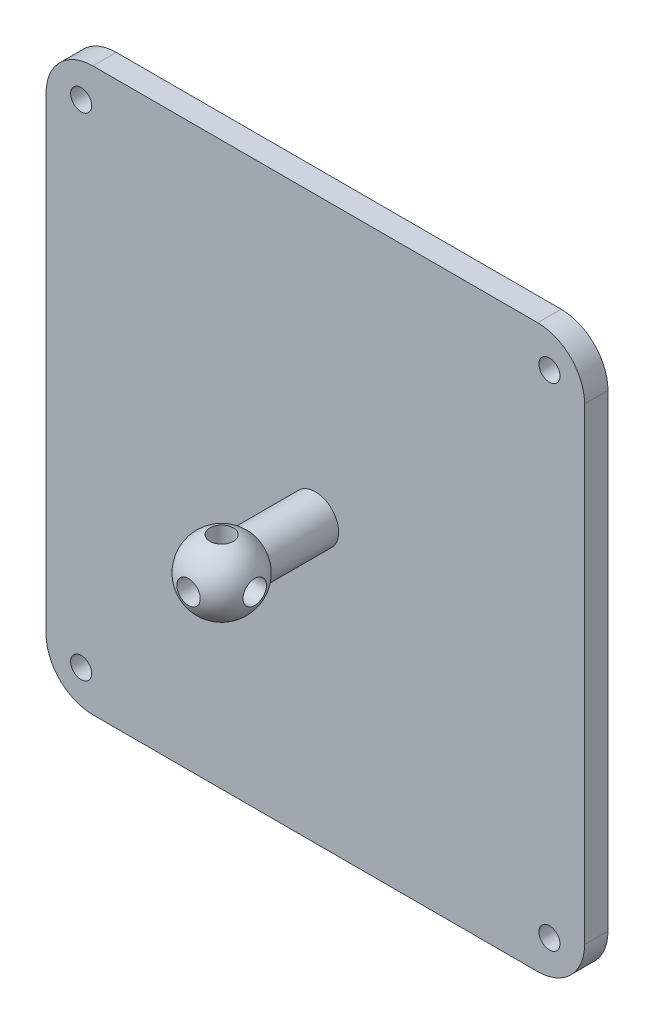
ISO-10303-21;
HEADER;
FILE_DESCRIPTION(('STEP AP214'),'2;1');
FILE_NAME('part.step','',(''),(''),'','','');
FILE_SCHEMA(('AUTOMOTIVE_DESIGN { 1 0 10303 214 1 1 1 1 }'));
ENDSEC;
DATA;
#1=APPLICATION_CONTEXT('core data for automotive mechanical design processes');
#2=APPLICATION_PROTOCOL_DEFINITION('international standard','automotive_design',2000,#1);
#3=PRODUCT_CONTEXT('',#1,'mechanical');
#4=PRODUCT('Part','Part','',(#3));
#5=PRODUCT_RELATED_PRODUCT_CATEGORY('part','',(#4));
#6=PRODUCT_DEFINITION_FORMATION('','',#4);
#7=PRODUCT_DEFINITION_CONTEXT('part definition',#1,'design');
#8=PRODUCT_DEFINITION('design','',#6,#7);
#9=PRODUCT_DEFINITION_SHAPE('','',#8);
#10=(LENGTH_UNIT() NAMED_UNIT(*) SI_UNIT(.MILLI.,.METRE.));
#11=(NAMED_UNIT(*) PLANE_ANGLE_UNIT() SI_UNIT($,.RADIAN.));
#12=(NAMED_UNIT(*) SI_UNIT($,.STERADIAN.) SOLID_ANGLE_UNIT());
#13=UNCERTAINTY_MEASURE_WITH_UNIT(LENGTH_MEASURE(1.E-05),#10,'distance_accuracy_value','');
#14=(GEOMETRIC_REPRESENTATION_CONTEXT(3) GLOBAL_UNCERTAINTY_ASSIGNED_CONTEXT((#13)) GLOBAL_UNIT_ASSIGNED_CONTEXT((#10,
#11,#12)) REPRESENTATION_CONTEXT('',''));
#15=CARTESIAN_POINT('',(0.,0.,0.));
#16=DIRECTION('',(0.,0.,1.));
#17=DIRECTION('',(1.,0.,0.));
#18=AXIS2_PLACEMENT_3D('',#15,#16,#17);
#19=CARTESIAN_POINT('',(0.,0.,20.));
#20=DIRECTION('',(0.,0.,-1.));
#21=DIRECTION('',(-1.,0.,0.));
#22=AXIS2_PLACEMENT_3D('',#19,#20,#21);
#23=SPHERICAL_SURFACE('',#22,7.5);
#24=CARTESIAN_POINT('',(0.,0.,14.4098300562505));
#25=DIRECTION('',(0.,0.,1.));
#26=DIRECTION('',(1.,0.,0.));
#27=AXIS2_PLACEMENT_3D('',#24,#25,#26);
#28=CIRCLE('',#27,5.);
#29=CARTESIAN_POINT('',(5.,0.,14.4098300562505));
#30=VERTEX_POINT('',#29);
#31=EDGE_CURVE('E159',#30,#30,#28,.T.);
#32=ORIENTED_EDGE('',*,*,#31,.T.);
#33=EDGE_LOOP('',(#32));
#34=FACE_BOUND('',#33,.T.);
#35=CARTESIAN_POINT('',(0.,7.07106781186548,20.));
#36=DIRECTION('',(0.,-1.,0.));
#37=DIRECTION('',(0.,0.,-1.));
#38=AXIS2_PLACEMENT_3D('',#35,#36,#37);
#39=CIRCLE('',#38,2.49999999999999);
#40=CARTESIAN_POINT('',(0.,7.07106781186548,17.5));
#41=VERTEX_POINT('',#40);
#42=EDGE_CURVE('E231',#41,#41,#39,.F.);
#43=ORIENTED_EDGE('',*,*,#42,.F.);
#44=EDGE_LOOP('',(#43));
#45=FACE_BOUND('',#44,.T.);
#46=CARTESIAN_POINT('',(0.,0.,27.0710678118655));
#47=DIRECTION('',(0.,0.,-1.));
#48=DIRECTION('',(-1.,0.,0.));
#49=AXIS2_PLACEMENT_3D('',#46,#47,#48);
#50=CIRCLE('',#49,2.5);
#51=CARTESIAN_POINT('',(-2.5,0.,27.0710678118655));
#52=VERTEX_POINT('',#51);
#53=EDGE_CURVE('E241',#52,#52,#50,.F.);
#54=ORIENTED_EDGE('',*,*,#53,.F.);
#55=EDGE_LOOP('',(#54));
#56=FACE_BOUND('',#55,.T.);
#57=CARTESIAN_POINT('',(7.07106781186548,0.,20.));
#58=DIRECTION('',(-1.,0.,0.));
#59=DIRECTION('',(0.,0.,1.));
#60=AXIS2_PLACEMENT_3D('',#57,#58,#59);
#61=CIRCLE('',#60,2.5);
#62=CARTESIAN_POINT('',(7.07106781186548,0.,22.5));
#63=VERTEX_POINT('',#62);
#64=EDGE_CURVE('E512',#63,#63,#61,.F.);
#65=ORIENTED_EDGE('',*,*,#64,.F.);
#66=EDGE_LOOP('',(#65));
#67=FACE_BOUND('',#66,.T.);
#68=ADVANCED_FACE('F38',(#34,#45,#56,#67),#23,.T.);
#69=CARTESIAN_POINT('',(0.,42.1775425759151,20.));
#70=DIRECTION('',(0.,1.,0.));
#71=DIRECTION('',(0.,0.,1.));
#72=AXIS2_PLACEMENT_3D('',#69,#70,#71);
#73=CYLINDRICAL_SURFACE('',#72,2.49999999999999);
#74=ORIENTED_EDGE('',*,*,#42,.T.);
#75=EDGE_LOOP('',(#74));
#76=FACE_BOUND('',#75,.T.);
#77=CARTESIAN_POINT('',(0.,0.,20.));
#78=DIRECTION('',(0.,0.707106781186547,0.707106781186547));
#79=DIRECTION('',(0.,0.707106781186547,-0.707106781186547));
#80=AXIS2_PLACEMENT_3D('',#77,#78,#79);
#81=ELLIPSE('',#80,3.53553390593273,2.5);
#82=CARTESIAN_POINT('',(-1.76776695296637,1.76776695296636,18.2322330470336));
#83=VERTEX_POINT('',#82);
#84=CARTESIAN_POINT('',(1.76776695296637,1.76776695296636,18.2322330470336));
#85=VERTEX_POINT('',#84);
#86=EDGE_CURVE('E140',#83,#85,#81,.F.);
#87=ORIENTED_EDGE('',*,*,#86,.T.);
#88=CARTESIAN_POINT('',(0.,0.,20.));
#89=DIRECTION('',(-0.707106781186547,0.707106781186547,0.));
#90=DIRECTION('',(0.707106781186547,0.707106781186547,0.));
#91=AXIS2_PLACEMENT_3D('',#88,#89,#90);
#92=ELLIPSE('',#91,3.53553390593273,2.5);
#93=CARTESIAN_POINT('',(1.76776695296636,1.76776695296637,21.7677669529664));
#94=VERTEX_POINT('',#93);
#95=EDGE_CURVE('E134',#85,#94,#92,.F.);
#96=ORIENTED_EDGE('',*,*,#95,.T.);
#97=CARTESIAN_POINT('',(0.,0.,20.));
#98=DIRECTION('',(0.,0.707106781186547,-0.707106781186547));
#99=DIRECTION('',(0.,0.707106781186547,0.707106781186547));
#100=AXIS2_PLACEMENT_3D('',#97,#98,#99);
#101=ELLIPSE('',#100,3.53553390593273,2.5);
#102=CARTESIAN_POINT('',(-1.76776695296636,1.76776695296637,21.7677669529664));
#103=VERTEX_POINT('',#102);
#104=EDGE_CURVE('E155',#94,#103,#101,.F.);
#105=ORIENTED_EDGE('',*,*,#104,.T.);
#106=CARTESIAN_POINT('',(0.,0.,20.));
#107=DIRECTION('',(0.707106781186547,0.707106781186547,0.));
#108=DIRECTION('',(-0.707106781186547,0.707106781186547,0.));
#109=AXIS2_PLACEMENT_3D('',#106,#107,#108);
#110=ELLIPSE('',#109,3.53553390593273,2.5);
#111=EDGE_CURVE('E514',#103,#83,#110,.F.);
#112=ORIENTED_EDGE('',*,*,#111,.T.);
#113=EDGE_LOOP('',(#87,#96,#105,#112));
#114=FACE_BOUND('',#113,.T.);
#115=ADVANCED_FACE('F290',(#76,#114),#73,.F.);
#116=CARTESIAN_POINT('',(0.,0.,46.4260406002012));
#117=DIRECTION('',(0.,0.,1.));
#118=DIRECTION('',(1.,0.,0.));
#119=AXIS2_PLACEMENT_3D('',#116,#117,#118);
#120=CYLINDRICAL_SURFACE('',#119,2.5);
#121=ORIENTED_EDGE('',*,*,#53,.T.);
#122=EDGE_LOOP('',(#121));
#123=FACE_BOUND('',#122,.T.);
#124=ORIENTED_EDGE('',*,*,#104,.F.);
#125=CARTESIAN_POINT('',(0.,0.,20.));
#126=DIRECTION('',(-0.707106781186547,0.,0.707106781186547));
#127=DIRECTION('',(0.707106781186547,0.,0.707106781186547));
#128=AXIS2_PLACEMENT_3D('',#125,#126,#127);
#129=ELLIPSE('',#128,3.53553390593274,2.5);
#130=CARTESIAN_POINT('',(1.76776695296637,-1.76776695296637,21.7677669529664));
#131=VERTEX_POINT('',#130);
#132=EDGE_CURVE('E150',#94,#131,#129,.F.);
#133=ORIENTED_EDGE('',*,*,#132,.T.);
#134=CARTESIAN_POINT('',(0.,0.,20.));
#135=DIRECTION('',(0.,0.707106781186547,0.707106781186547));
#136=DIRECTION('',(0.,0.707106781186547,-0.707106781186547));
#137=AXIS2_PLACEMENT_3D('',#134,#135,#136);
#138=ELLIPSE('',#137,3.53553390593273,2.5);
#139=CARTESIAN_POINT('',(-1.76776695296637,-1.76776695296637,21.7677669529664));
#140=VERTEX_POINT('',#139);
#141=EDGE_CURVE('E149',#140,#131,#138,.T.);
#142=ORIENTED_EDGE('',*,*,#141,.F.);
#143=CARTESIAN_POINT('',(0.,0.,20.));
#144=DIRECTION('',(0.707106781186547,0.,0.707106781186547));
#145=DIRECTION('',(-0.707106781186547,0.,0.707106781186547));
#146=AXIS2_PLACEMENT_3D('',#143,#144,#145);
#147=ELLIPSE('',#146,3.53553390593274,2.5);
#148=EDGE_CURVE('E519',#140,#103,#147,.F.);
#149=ORIENTED_EDGE('',*,*,#148,.T.);
#150=EDGE_LOOP('',(#124,#133,#142,#149));
#151=FACE_BOUND('',#150,.T.);
#152=ADVANCED_FACE('F296',(#123,#151),#120,.F.);
#153=CARTESIAN_POINT('',(0.,-3.,20.));
#154=DIRECTION('',(0.,1.,0.));
#155=DIRECTION('',(0.,0.,1.));
#156=AXIS2_PLACEMENT_3D('',#153,#154,#155);
#157=CIRCLE('',#156,2.5);
#158=CARTESIAN_POINT('',(0.,-3.,22.5));
#159=VERTEX_POINT('',#158);
#160=EDGE_CURVE('E234',#159,#159,#157,.T.);
#161=ORIENTED_EDGE('',*,*,#160,.F.);
#162=EDGE_LOOP('',(#161));
#163=FACE_BOUND('',#162,.T.);
#164=CARTESIAN_POINT('',(0.,0.,20.));
#165=DIRECTION('',(0.,0.707106781186547,-0.707106781186547));
#166=DIRECTION('',(0.,0.707106781186547,0.707106781186547));
#167=AXIS2_PLACEMENT_3D('',#164,#165,#166);
#168=ELLIPSE('',#167,3.53553390593273,2.5);
#169=CARTESIAN_POINT('',(1.76776695296637,-1.76776695296636,18.2322330470336));
#170=VERTEX_POINT('',#169);
#171=CARTESIAN_POINT('',(-1.76776695296637,-1.76776695296636,18.2322330470336));
#172=VERTEX_POINT('',#171);
#173=EDGE_CURVE('E147',#170,#172,#168,.T.);
#174=ORIENTED_EDGE('',*,*,#173,.T.);
#175=CARTESIAN_POINT('',(0.,0.,20.));
#176=DIRECTION('',(-0.707106781186547,0.707106781186547,0.));
#177=DIRECTION('',(0.707106781186547,0.707106781186547,0.));
#178=AXIS2_PLACEMENT_3D('',#175,#176,#177);
#179=ELLIPSE('',#178,3.53553390593273,2.5);
#180=EDGE_CURVE('E522',#172,#140,#179,.T.);
#181=ORIENTED_EDGE('',*,*,#180,.T.);
#182=ORIENTED_EDGE('',*,*,#141,.T.);
#183=CARTESIAN_POINT('',(0.,0.,20.));
#184=DIRECTION('',(0.707106781186547,0.707106781186547,0.));
#185=DIRECTION('',(-0.707106781186547,0.707106781186547,0.));
#186=AXIS2_PLACEMENT_3D('',#183,#184,#185);
#187=ELLIPSE('',#186,3.53553390593273,2.5);
#188=EDGE_CURVE('E131',#131,#170,#187,.T.);
#189=ORIENTED_EDGE('',*,*,#188,.T.);
#190=EDGE_LOOP('',(#174,#181,#182,#189));
#191=FACE_BOUND('',#190,.T.);
#192=ADVANCED_FACE('F145',(#163,#191),#73,.F.);
#193=CARTESIAN_POINT('',(0.,0.,17.));
#194=DIRECTION('',(0.,0.,1.));
#195=DIRECTION('',(1.,0.,0.));
#196=AXIS2_PLACEMENT_3D('',#193,#194,#195);
#197=CIRCLE('',#196,2.5);
#198=CARTESIAN_POINT('',(2.5,0.,17.));
#199=VERTEX_POINT('',#198);
#200=EDGE_CURVE('E246',#199,#199,#197,.T.);
#201=ORIENTED_EDGE('',*,*,#200,.F.);
#202=EDGE_LOOP('',(#201));
#203=FACE_BOUND('',#202,.T.);
#204=ORIENTED_EDGE('',*,*,#86,.F.);
#205=CARTESIAN_POINT('',(0.,0.,20.));
#206=DIRECTION('',(-0.707106781186547,0.,0.707106781186547));
#207=DIRECTION('',(0.707106781186547,0.,0.707106781186547));
#208=AXIS2_PLACEMENT_3D('',#205,#206,#207);
#209=ELLIPSE('',#208,3.53553390593274,2.5);
#210=EDGE_CURVE('E139',#83,#172,#209,.T.);
#211=ORIENTED_EDGE('',*,*,#210,.T.);
#212=ORIENTED_EDGE('',*,*,#173,.F.);
#213=CARTESIAN_POINT('',(0.,0.,20.));
#214=DIRECTION('',(0.707106781186547,0.,0.707106781186547));
#215=DIRECTION('',(-0.707106781186547,0.,0.707106781186547));
#216=AXIS2_PLACEMENT_3D('',#213,#214,#215);
#217=ELLIPSE('',#216,3.53553390593274,2.5);
#218=EDGE_CURVE('E127',#170,#85,#217,.T.);
#219=ORIENTED_EDGE('',*,*,#218,.T.);
#220=EDGE_LOOP('',(#204,#211,#212,#219));
#221=FACE_BOUND('',#220,.T.);
#222=ADVANCED_FACE('F154',(#203,#221),#120,.F.);
#223=CARTESIAN_POINT('',(0.,0.,20.));
#224=DIRECTION('',(0.,0.,-1.));
#225=DIRECTION('',(-1.,0.,0.));
#226=AXIS2_PLACEMENT_3D('',#223,#224,#225);
#227=CYLINDRICAL_SURFACE('',#226,5.);
#228=CARTESIAN_POINT('',(0.,0.,0.));
#229=DIRECTION('',(0.,0.,1.));
#230=DIRECTION('',(1.,0.,0.));
#231=AXIS2_PLACEMENT_3D('',#228,#229,#230);
#232=CIRCLE('',#231,5.);
#233=CARTESIAN_POINT('',(5.,0.,0.));
#234=VERTEX_POINT('',#233);
#235=EDGE_CURVE('E233',#234,#234,#232,.T.);
#236=ORIENTED_EDGE('',*,*,#235,.T.);
#237=EDGE_LOOP('',(#236));
#238=FACE_BOUND('',#237,.T.);
#239=ORIENTED_EDGE('',*,*,#31,.F.);
#240=EDGE_LOOP('',(#239));
#241=FACE_BOUND('',#240,.T.);
#242=ADVANCED_FACE('F302',(#238,#241),#227,.T.);
#243=CARTESIAN_POINT('',(-57.5,60.,-5.));
#244=DIRECTION('',(-1.,0.,0.));
#245=DIRECTION('',(0.,-1.,0.));
#246=AXIS2_PLACEMENT_3D('',#243,#244,#245);
#247=PLANE('',#246);
#248=DIRECTION('',(0.,-1.,0.));
#249=VECTOR('',#248,1.);
#250=CARTESIAN_POINT('',(-57.5,60.,0.));
#251=LINE('',#250,#249);
#252=CARTESIAN_POINT('',(-57.5,50.,0.));
#253=VERTEX_POINT('',#252);
#254=CARTESIAN_POINT('',(-57.5,-50.,0.));
#255=VERTEX_POINT('',#254);
#256=EDGE_CURVE('E203',#253,#255,#251,.T.);
#257=ORIENTED_EDGE('',*,*,#256,.F.);
#258=DIRECTION('',(0.,0.,1.));
#259=VECTOR('',#258,1.);
#260=CARTESIAN_POINT('',(-57.5,50.,-5.));
#261=LINE('',#260,#259);
#262=CARTESIAN_POINT('',(-57.5,50.,-5.));
#263=VERTEX_POINT('',#262);
#264=EDGE_CURVE('E193',#253,#263,#261,.F.);
#265=ORIENTED_EDGE('',*,*,#264,.T.);
#266=DIRECTION('',(0.,-1.,0.));
#267=VECTOR('',#266,1.);
#268=CARTESIAN_POINT('',(-57.5,60.,-5.));
#269=LINE('',#268,#267);
#270=CARTESIAN_POINT('',(-57.5,-50.,-5.));
#271=VERTEX_POINT('',#270);
#272=EDGE_CURVE('E200',#263,#271,#269,.T.);
#273=ORIENTED_EDGE('',*,*,#272,.T.);
#274=DIRECTION('',(0.,0.,1.));
#275=VECTOR('',#274,1.);
#276=CARTESIAN_POINT('',(-57.5,-50.,-5.));
#277=LINE('',#276,#275);
#278=EDGE_CURVE('E190',#271,#255,#277,.T.);
#279=ORIENTED_EDGE('',*,*,#278,.T.);
#280=EDGE_LOOP('',(#257,#265,#273,#279));
#281=FACE_BOUND('',#280,.T.);
#282=ADVANCED_FACE('F199',(#281),#247,.T.);
#283=CARTESIAN_POINT('',(-57.5,60.,-5.));
#284=DIRECTION('',(0.,1.,0.));
#285=DIRECTION('',(-1.,0.,0.));
#286=AXIS2_PLACEMENT_3D('',#283,#284,#285);
#287=PLANE('',#286);
#288=DIRECTION('',(-1.,0.,0.));
#289=VECTOR('',#288,1.);
#290=CARTESIAN_POINT('',(-57.5,60.,0.));
#291=LINE('',#290,#289);
#292=CARTESIAN_POINT('',(47.5,60.,0.));
#293=VERTEX_POINT('',#292);
#294=CARTESIAN_POINT('',(-47.5,60.,0.));
#295=VERTEX_POINT('',#294);
#296=EDGE_CURVE('E211',#293,#295,#291,.T.);
#297=ORIENTED_EDGE('',*,*,#296,.F.);
#298=DIRECTION('',(0.,0.,1.));
#299=VECTOR('',#298,1.);
#300=CARTESIAN_POINT('',(47.5,60.,-5.));
#301=LINE('',#300,#299);
#302=CARTESIAN_POINT('',(47.5,60.,-5.));
#303=VERTEX_POINT('',#302);
#304=EDGE_CURVE('E181',#293,#303,#301,.F.);
#305=ORIENTED_EDGE('',*,*,#304,.T.);
#306=DIRECTION('',(-1.,0.,0.));
#307=VECTOR('',#306,1.);
#308=CARTESIAN_POINT('',(-57.5,60.,-5.));
#309=LINE('',#308,#307);
#310=CARTESIAN_POINT('',(-47.5,60.,-5.));
#311=VERTEX_POINT('',#310);
#312=EDGE_CURVE('E220',#303,#311,#309,.T.);
#313=ORIENTED_EDGE('',*,*,#312,.T.);
#314=DIRECTION('',(0.,0.,1.));
#315=VECTOR('',#314,1.);
#316=CARTESIAN_POINT('',(-47.5,60.,-5.));
#317=LINE('',#316,#315);
#318=EDGE_CURVE('E178',#311,#295,#317,.T.);
#319=ORIENTED_EDGE('',*,*,#318,.T.);
#320=EDGE_LOOP('',(#297,#305,#313,#319));
#321=FACE_BOUND('',#320,.T.);
#322=ADVANCED_FACE('F218',(#321),#287,.T.);
#323=CARTESIAN_POINT('',(57.5,60.,-5.));
#324=DIRECTION('',(1.,0.,0.));
#325=DIRECTION('',(0.,0.,-1.));
#326=AXIS2_PLACEMENT_3D('',#323,#324,#325);
#327=PLANE('',#326);
#328=DIRECTION('',(0.,1.,0.));
#329=VECTOR('',#328,1.);
#330=CARTESIAN_POINT('',(57.5,60.,-5.));
#331=LINE('',#330,#329);
#332=CARTESIAN_POINT('',(57.5,-50.,-5.));
#333=VERTEX_POINT('',#332);
#334=CARTESIAN_POINT('',(57.5,50.,-5.));
#335=VERTEX_POINT('',#334);
#336=EDGE_CURVE('E274',#333,#335,#331,.T.);
#337=ORIENTED_EDGE('',*,*,#336,.T.);
#338=DIRECTION('',(0.,0.,1.));
#339=VECTOR('',#338,1.);
#340=CARTESIAN_POINT('',(57.5,50.,-5.));
#341=LINE('',#340,#339);
#342=CARTESIAN_POINT('',(57.5,50.,0.));
#343=VERTEX_POINT('',#342);
#344=EDGE_CURVE('E167',#335,#343,#341,.T.);
#345=ORIENTED_EDGE('',*,*,#344,.T.);
#346=DIRECTION('',(0.,1.,0.));
#347=VECTOR('',#346,1.);
#348=CARTESIAN_POINT('',(57.5,60.,0.));
#349=LINE('',#348,#347);
#350=CARTESIAN_POINT('',(57.5,-50.,0.));
#351=VERTEX_POINT('',#350);
#352=EDGE_CURVE('E224',#351,#343,#349,.T.);
#353=ORIENTED_EDGE('',*,*,#352,.F.);
#354=DIRECTION('',(0.,0.,1.));
#355=VECTOR('',#354,1.);
#356=CARTESIAN_POINT('',(57.5,-50.,-5.));
#357=LINE('',#356,#355);
#358=EDGE_CURVE('E165',#351,#333,#357,.F.);
#359=ORIENTED_EDGE('',*,*,#358,.T.);
#360=EDGE_LOOP('',(#337,#345,#353,#359));
#361=FACE_BOUND('',#360,.T.);
#362=ADVANCED_FACE('F330',(#361),#327,.T.);
#363=CARTESIAN_POINT('',(-57.5,-60.,-5.));
#364=DIRECTION('',(0.,-1.,0.));
#365=DIRECTION('',(1.,0.,0.));
#366=AXIS2_PLACEMENT_3D('',#363,#364,#365);
#367=PLANE('',#366);
#368=DIRECTION('',(1.,0.,0.));
#369=VECTOR('',#368,1.);
#370=CARTESIAN_POINT('',(-57.5,-60.,-5.));
#371=LINE('',#370,#369);
#372=CARTESIAN_POINT('',(-47.5,-60.,-5.));
#373=VERTEX_POINT('',#372);
#374=CARTESIAN_POINT('',(47.4999999999999,-60.,-5.));
#375=VERTEX_POINT('',#374);
#376=EDGE_CURVE('E210',#373,#375,#371,.T.);
#377=ORIENTED_EDGE('',*,*,#376,.T.);
#378=DIRECTION('',(0.,0.,1.));
#379=VECTOR('',#378,1.);
#380=CARTESIAN_POINT('',(47.5,-60.,-5.));
#381=LINE('',#380,#379);
#382=CARTESIAN_POINT('',(47.4999999999999,-60.,0.));
#383=VERTEX_POINT('',#382);
#384=EDGE_CURVE('E11',#375,#383,#381,.T.);
#385=ORIENTED_EDGE('',*,*,#384,.T.);
#386=DIRECTION('',(1.,0.,0.));
#387=VECTOR('',#386,1.);
#388=CARTESIAN_POINT('',(-57.5,-60.,0.));
#389=LINE('',#388,#387);
#390=CARTESIAN_POINT('',(-47.5,-60.,0.));
#391=VERTEX_POINT('',#390);
#392=EDGE_CURVE('E226',#391,#383,#389,.T.);
#393=ORIENTED_EDGE('',*,*,#392,.F.);
#394=DIRECTION('',(0.,0.,1.));
#395=VECTOR('',#394,1.);
#396=CARTESIAN_POINT('',(-47.5,-60.,-5.));
#397=LINE('',#396,#395);
#398=EDGE_CURVE('E46',#391,#373,#397,.F.);
#399=ORIENTED_EDGE('',*,*,#398,.T.);
#400=EDGE_LOOP('',(#377,#385,#393,#399));
#401=FACE_BOUND('',#400,.T.);
#402=ADVANCED_FACE('F280',(#401),#367,.T.);
#403=CARTESIAN_POINT('',(0.,0.,-5.));
#404=DIRECTION('',(0.,0.,1.));
#405=DIRECTION('',(1.,0.,0.));
#406=AXIS2_PLACEMENT_3D('',#403,#404,#405);
#407=PLANE('',#406);
#408=CARTESIAN_POINT('',(-50.,52.5,-5.));
#409=DIRECTION('',(0.,0.,1.));
#410=DIRECTION('',(-1.,0.,0.));
#411=AXIS2_PLACEMENT_3D('',#408,#409,#410);
#412=CIRCLE('',#411,2.25);
#413=CARTESIAN_POINT('',(-52.25,52.5,-5.));
#414=VERTEX_POINT('',#413);
#415=EDGE_CURVE('E250',#414,#414,#412,.T.);
#416=ORIENTED_EDGE('',*,*,#415,.T.);
#417=EDGE_LOOP('',(#416));
#418=FACE_BOUND('',#417,.T.);
#419=CARTESIAN_POINT('',(-50.,-52.5,-5.));
#420=DIRECTION('',(0.,0.,1.));
#421=DIRECTION('',(1.,0.,0.));
#422=AXIS2_PLACEMENT_3D('',#419,#420,#421);
#423=CIRCLE('',#422,2.25);
#424=CARTESIAN_POINT('',(-47.75,-52.5,-5.));
#425=VERTEX_POINT('',#424);
#426=EDGE_CURVE('E256',#425,#425,#423,.T.);
#427=ORIENTED_EDGE('',*,*,#426,.T.);
#428=EDGE_LOOP('',(#427));
#429=FACE_BOUND('',#428,.T.);
#430=CARTESIAN_POINT('',(50.,-52.5,-5.));
#431=DIRECTION('',(0.,0.,1.));
#432=DIRECTION('',(-1.,0.,0.));
#433=AXIS2_PLACEMENT_3D('',#430,#431,#432);
#434=CIRCLE('',#433,2.25);
#435=CARTESIAN_POINT('',(47.75,-52.5,-5.));
#436=VERTEX_POINT('',#435);
#437=EDGE_CURVE('E262',#436,#436,#434,.T.);
#438=ORIENTED_EDGE('',*,*,#437,.T.);
#439=EDGE_LOOP('',(#438));
#440=FACE_BOUND('',#439,.T.);
#441=CARTESIAN_POINT('',(50.,52.5,-5.));
#442=DIRECTION('',(0.,0.,1.));
#443=DIRECTION('',(1.,0.,0.));
#444=AXIS2_PLACEMENT_3D('',#441,#442,#443);
#445=CIRCLE('',#444,2.25);
#446=CARTESIAN_POINT('',(52.25,52.5,-5.));
#447=VERTEX_POINT('',#446);
#448=EDGE_CURVE('E268',#447,#447,#445,.T.);
#449=ORIENTED_EDGE('',*,*,#448,.T.);
#450=EDGE_LOOP('',(#449));
#451=FACE_BOUND('',#450,.T.);
#452=ORIENTED_EDGE('',*,*,#312,.F.);
#453=CARTESIAN_POINT('',(47.5,50.,-5.));
#454=DIRECTION('',(0.,0.,1.));
#455=DIRECTION('',(1.,0.,0.));
#456=AXIS2_PLACEMENT_3D('',#453,#454,#455);
#457=CIRCLE('',#456,10.);
#458=EDGE_CURVE('E188',#303,#335,#457,.F.);
#459=ORIENTED_EDGE('',*,*,#458,.T.);
#460=ORIENTED_EDGE('',*,*,#336,.F.);
#461=CARTESIAN_POINT('',(47.5,-50.,-5.));
#462=DIRECTION('',(0.,0.,1.));
#463=DIRECTION('',(1.,0.,0.));
#464=AXIS2_PLACEMENT_3D('',#461,#462,#463);
#465=CIRCLE('',#464,10.);
#466=EDGE_CURVE('E53',#333,#375,#465,.F.);
#467=ORIENTED_EDGE('',*,*,#466,.T.);
#468=ORIENTED_EDGE('',*,*,#376,.F.);
#469=CARTESIAN_POINT('',(-47.5,-50.,-5.));
#470=DIRECTION('',(0.,0.,1.));
#471=DIRECTION('',(1.,0.,0.));
#472=AXIS2_PLACEMENT_3D('',#469,#470,#471);
#473=CIRCLE('',#472,10.);
#474=EDGE_CURVE('E183',#373,#271,#473,.F.);
#475=ORIENTED_EDGE('',*,*,#474,.T.);
#476=ORIENTED_EDGE('',*,*,#272,.F.);
#477=CARTESIAN_POINT('',(-47.5,50.,-5.));
#478=DIRECTION('',(0.,0.,1.));
#479=DIRECTION('',(1.,0.,0.));
#480=AXIS2_PLACEMENT_3D('',#477,#478,#479);
#481=CIRCLE('',#480,10.);
#482=EDGE_CURVE('E186',#263,#311,#481,.F.);
#483=ORIENTED_EDGE('',*,*,#482,.T.);
#484=EDGE_LOOP('',(#452,#459,#460,#467,#468,#475,#476,#483));
#485=FACE_BOUND('',#484,.T.);
#486=ADVANCED_FACE('F207',(#418,#429,#440,#451,#485),#407,.F.);
#487=CARTESIAN_POINT('',(0.,0.,0.));
#488=DIRECTION('',(0.,0.,1.));
#489=DIRECTION('',(1.,0.,0.));
#490=AXIS2_PLACEMENT_3D('',#487,#488,#489);
#491=PLANE('',#490);
#492=ORIENTED_EDGE('',*,*,#235,.F.);
#493=EDGE_LOOP('',(#492));
#494=FACE_BOUND('',#493,.T.);
#495=CARTESIAN_POINT('',(-50.,52.5,0.));
#496=DIRECTION('',(0.,0.,1.));
#497=DIRECTION('',(-1.,0.,0.));
#498=AXIS2_PLACEMENT_3D('',#495,#496,#497);
#499=CIRCLE('',#498,2.25);
#500=CARTESIAN_POINT('',(-52.25,52.5,0.));
#501=VERTEX_POINT('',#500);
#502=EDGE_CURVE('E238',#501,#501,#499,.T.);
#503=ORIENTED_EDGE('',*,*,#502,.F.);
#504=EDGE_LOOP('',(#503));
#505=FACE_BOUND('',#504,.T.);
#506=CARTESIAN_POINT('',(-50.,-52.5,0.));
#507=DIRECTION('',(0.,0.,1.));
#508=DIRECTION('',(1.,0.,0.));
#509=AXIS2_PLACEMENT_3D('',#506,#507,#508);
#510=CIRCLE('',#509,2.25);
#511=CARTESIAN_POINT('',(-47.75,-52.5,0.));
#512=VERTEX_POINT('',#511);
#513=EDGE_CURVE('E253',#512,#512,#510,.T.);
#514=ORIENTED_EDGE('',*,*,#513,.F.);
#515=EDGE_LOOP('',(#514));
#516=FACE_BOUND('',#515,.T.);
#517=CARTESIAN_POINT('',(50.,-52.5,0.));
#518=DIRECTION('',(0.,0.,1.));
#519=DIRECTION('',(-1.,0.,0.));
#520=AXIS2_PLACEMENT_3D('',#517,#518,#519);
#521=CIRCLE('',#520,2.25);
#522=CARTESIAN_POINT('',(47.75,-52.5,0.));
#523=VERTEX_POINT('',#522);
#524=EDGE_CURVE('E259',#523,#523,#521,.T.);
#525=ORIENTED_EDGE('',*,*,#524,.F.);
#526=EDGE_LOOP('',(#525));
#527=FACE_BOUND('',#526,.T.);
#528=CARTESIAN_POINT('',(50.,52.5,0.));
#529=DIRECTION('',(0.,0.,1.));
#530=DIRECTION('',(1.,0.,0.));
#531=AXIS2_PLACEMENT_3D('',#528,#529,#530);
#532=CIRCLE('',#531,2.25);
#533=CARTESIAN_POINT('',(52.25,52.5,0.));
#534=VERTEX_POINT('',#533);
#535=EDGE_CURVE('E265',#534,#534,#532,.T.);
#536=ORIENTED_EDGE('',*,*,#535,.F.);
#537=EDGE_LOOP('',(#536));
#538=FACE_BOUND('',#537,.T.);
#539=ORIENTED_EDGE('',*,*,#352,.T.);
#540=CARTESIAN_POINT('',(47.5,50.,0.));
#541=DIRECTION('',(0.,0.,1.));
#542=DIRECTION('',(1.,0.,0.));
#543=AXIS2_PLACEMENT_3D('',#540,#541,#542);
#544=CIRCLE('',#543,10.);
#545=EDGE_CURVE('E176',#343,#293,#544,.T.);
#546=ORIENTED_EDGE('',*,*,#545,.T.);
#547=ORIENTED_EDGE('',*,*,#296,.T.);
#548=CARTESIAN_POINT('',(-47.5,50.,0.));
#549=DIRECTION('',(0.,0.,1.));
#550=DIRECTION('',(1.,0.,0.));
#551=AXIS2_PLACEMENT_3D('',#548,#549,#550);
#552=CIRCLE('',#551,10.);
#553=EDGE_CURVE('E174',#295,#253,#552,.T.);
#554=ORIENTED_EDGE('',*,*,#553,.T.);
#555=ORIENTED_EDGE('',*,*,#256,.T.);
#556=CARTESIAN_POINT('',(-47.5,-50.,0.));
#557=DIRECTION('',(0.,0.,1.));
#558=DIRECTION('',(1.,0.,0.));
#559=AXIS2_PLACEMENT_3D('',#556,#557,#558);
#560=CIRCLE('',#559,10.);
#561=EDGE_CURVE('E170',#255,#391,#560,.T.);
#562=ORIENTED_EDGE('',*,*,#561,.T.);
#563=ORIENTED_EDGE('',*,*,#392,.T.);
#564=CARTESIAN_POINT('',(47.5,-50.,0.));
#565=DIRECTION('',(0.,0.,1.));
#566=DIRECTION('',(1.,0.,0.));
#567=AXIS2_PLACEMENT_3D('',#564,#565,#566);
#568=CIRCLE('',#567,10.);
#569=EDGE_CURVE('E172',#383,#351,#568,.T.);
#570=ORIENTED_EDGE('',*,*,#569,.T.);
#571=EDGE_LOOP('',(#539,#546,#547,#554,#555,#562,#563,#570));
#572=FACE_BOUND('',#571,.T.);
#573=ADVANCED_FACE('F223',(#494,#505,#516,#527,#538,#572),#491,.T.);
#574=CARTESIAN_POINT('',(50.,52.5,-5.));
#575=DIRECTION('',(0.,0.,1.));
#576=DIRECTION('',(1.,0.,0.));
#577=AXIS2_PLACEMENT_3D('',#574,#575,#576);
#578=CYLINDRICAL_SURFACE('',#577,2.25);
#579=ORIENTED_EDGE('',*,*,#448,.F.);
#580=EDGE_LOOP('',(#579));
#581=FACE_BOUND('',#580,.T.);
#582=ORIENTED_EDGE('',*,*,#535,.T.);
#583=EDGE_LOOP('',(#582));
#584=FACE_BOUND('',#583,.T.);
#585=ADVANCED_FACE('F317',(#581,#584),#578,.F.);
#586=CARTESIAN_POINT('',(50.,-52.5,-5.));
#587=DIRECTION('',(0.,0.,1.));
#588=DIRECTION('',(1.,0.,0.));
#589=AXIS2_PLACEMENT_3D('',#586,#587,#588);
#590=CYLINDRICAL_SURFACE('',#589,2.25);
#591=ORIENTED_EDGE('',*,*,#437,.F.);
#592=EDGE_LOOP('',(#591));
#593=FACE_BOUND('',#592,.T.);
#594=ORIENTED_EDGE('',*,*,#524,.T.);
#595=EDGE_LOOP('',(#594));
#596=FACE_BOUND('',#595,.T.);
#597=ADVANCED_FACE('F313',(#593,#596),#590,.F.);
#598=CARTESIAN_POINT('',(-50.,-52.5,-5.));
#599=DIRECTION('',(0.,0.,1.));
#600=DIRECTION('',(1.,0.,0.));
#601=AXIS2_PLACEMENT_3D('',#598,#599,#600);
#602=CYLINDRICAL_SURFACE('',#601,2.25);
#603=ORIENTED_EDGE('',*,*,#426,.F.);
#604=EDGE_LOOP('',(#603));
#605=FACE_BOUND('',#604,.T.);
#606=ORIENTED_EDGE('',*,*,#513,.T.);
#607=EDGE_LOOP('',(#606));
#608=FACE_BOUND('',#607,.T.);
#609=ADVANCED_FACE('F309',(#605,#608),#602,.F.);
#610=CARTESIAN_POINT('',(-50.,52.5,-5.));
#611=DIRECTION('',(0.,0.,1.));
#612=DIRECTION('',(1.,0.,0.));
#613=AXIS2_PLACEMENT_3D('',#610,#611,#612);
#614=CYLINDRICAL_SURFACE('',#613,2.25);
#615=ORIENTED_EDGE('',*,*,#415,.F.);
#616=EDGE_LOOP('',(#615));
#617=FACE_BOUND('',#616,.T.);
#618=ORIENTED_EDGE('',*,*,#502,.T.);
#619=EDGE_LOOP('',(#618));
#620=FACE_BOUND('',#619,.T.);
#621=ADVANCED_FACE('F306',(#617,#620),#614,.F.);
#622=CARTESIAN_POINT('',(0.,-3.,20.));
#623=DIRECTION('',(0.,1.,0.));
#624=DIRECTION('',(0.,0.,1.));
#625=AXIS2_PLACEMENT_3D('',#622,#623,#624);
#626=PLANE('',#625);
#627=ORIENTED_EDGE('',*,*,#160,.T.);
#628=EDGE_LOOP('',(#627));
#629=FACE_BOUND('',#628,.T.);
#630=ADVANCED_FACE('F301',(#629),#626,.T.);
#631=CARTESIAN_POINT('',(0.,2.5,17.));
#632=DIRECTION('',(0.,0.,1.));
#633=DIRECTION('',(1.,0.,0.));
#634=AXIS2_PLACEMENT_3D('',#631,#632,#633);
#635=PLANE('',#634);
#636=ORIENTED_EDGE('',*,*,#200,.T.);
#637=EDGE_LOOP('',(#636));
#638=FACE_BOUND('',#637,.T.);
#639=ADVANCED_FACE('F391',(#638),#635,.T.);
#640=CARTESIAN_POINT('',(-16.0301917569473,0.,20.));
#641=DIRECTION('',(-1.,0.,0.));
#642=DIRECTION('',(0.,0.,1.));
#643=AXIS2_PLACEMENT_3D('',#640,#641,#642);
#644=CYLINDRICAL_SURFACE('',#643,2.5);
#645=ORIENTED_EDGE('',*,*,#218,.F.);
#646=ORIENTED_EDGE('',*,*,#188,.F.);
#647=ORIENTED_EDGE('',*,*,#132,.F.);
#648=ORIENTED_EDGE('',*,*,#95,.F.);
#649=EDGE_LOOP('',(#645,#646,#647,#648));
#650=FACE_BOUND('',#649,.T.);
#651=ORIENTED_EDGE('',*,*,#64,.T.);
#652=EDGE_LOOP('',(#651));
#653=FACE_BOUND('',#652,.T.);
#654=ADVANCED_FACE('F129',(#650,#653),#644,.F.);
#655=ORIENTED_EDGE('',*,*,#148,.F.);
#656=ORIENTED_EDGE('',*,*,#180,.F.);
#657=ORIENTED_EDGE('',*,*,#210,.F.);
#658=ORIENTED_EDGE('',*,*,#111,.F.);
#659=EDGE_LOOP('',(#655,#656,#657,#658));
#660=FACE_BOUND('',#659,.T.);
#661=CARTESIAN_POINT('',(-3.,0.,20.));
#662=DIRECTION('',(-1.,0.,0.));
#663=DIRECTION('',(0.,0.,1.));
#664=AXIS2_PLACEMENT_3D('',#661,#662,#663);
#665=CIRCLE('',#664,2.5);
#666=CARTESIAN_POINT('',(-3.,0.,22.5));
#667=VERTEX_POINT('',#666);
#668=EDGE_CURVE('E151',#667,#667,#665,.T.);
#669=ORIENTED_EDGE('',*,*,#668,.T.);
#670=EDGE_LOOP('',(#669));
#671=FACE_BOUND('',#670,.T.);
#672=ADVANCED_FACE('F373',(#660,#671),#644,.F.);
#673=CARTESIAN_POINT('',(-3.,0.,17.5));
#674=DIRECTION('',(1.,0.,0.));
#675=DIRECTION('',(0.,0.,-1.));
#676=AXIS2_PLACEMENT_3D('',#673,#674,#675);
#677=PLANE('',#676);
#678=ORIENTED_EDGE('',*,*,#668,.F.);
#679=EDGE_LOOP('',(#678));
#680=FACE_BOUND('',#679,.T.);
#681=ADVANCED_FACE('F341',(#680),#677,.T.);
#682=CARTESIAN_POINT('',(47.5,50.,-5.));
#683=DIRECTION('',(0.,0.,1.));
#684=DIRECTION('',(1.,0.,0.));
#685=AXIS2_PLACEMENT_3D('',#682,#683,#684);
#686=CYLINDRICAL_SURFACE('',#685,10.);
#687=ORIENTED_EDGE('',*,*,#458,.F.);
#688=ORIENTED_EDGE('',*,*,#304,.F.);
#689=ORIENTED_EDGE('',*,*,#545,.F.);
#690=ORIENTED_EDGE('',*,*,#344,.F.);
#691=EDGE_LOOP('',(#687,#688,#689,#690));
#692=FACE_BOUND('',#691,.T.);
#693=ADVANCED_FACE('F338',(#692),#686,.T.);
#694=CARTESIAN_POINT('',(-47.5,50.,-5.));
#695=DIRECTION('',(0.,0.,1.));
#696=DIRECTION('',(1.,0.,0.));
#697=AXIS2_PLACEMENT_3D('',#694,#695,#696);
#698=CYLINDRICAL_SURFACE('',#697,10.);
#699=ORIENTED_EDGE('',*,*,#482,.F.);
#700=ORIENTED_EDGE('',*,*,#264,.F.);
#701=ORIENTED_EDGE('',*,*,#553,.F.);
#702=ORIENTED_EDGE('',*,*,#318,.F.);
#703=EDGE_LOOP('',(#699,#700,#701,#702));
#704=FACE_BOUND('',#703,.T.);
#705=ADVANCED_FACE('F214',(#704),#698,.T.);
#706=CARTESIAN_POINT('',(47.5,-50.,-5.));
#707=DIRECTION('',(0.,0.,1.));
#708=DIRECTION('',(1.,0.,0.));
#709=AXIS2_PLACEMENT_3D('',#706,#707,#708);
#710=CYLINDRICAL_SURFACE('',#709,10.);
#711=ORIENTED_EDGE('',*,*,#466,.F.);
#712=ORIENTED_EDGE('',*,*,#358,.F.);
#713=ORIENTED_EDGE('',*,*,#569,.F.);
#714=ORIENTED_EDGE('',*,*,#384,.F.);
#715=EDGE_LOOP('',(#711,#712,#713,#714));
#716=FACE_BOUND('',#715,.T.);
#717=ADVANCED_FACE('F284',(#716),#710,.T.);
#718=CARTESIAN_POINT('',(-47.5,-50.,-5.));
#719=DIRECTION('',(0.,0.,1.));
#720=DIRECTION('',(1.,0.,0.));
#721=AXIS2_PLACEMENT_3D('',#718,#719,#720);
#722=CYLINDRICAL_SURFACE('',#721,10.);
#723=ORIENTED_EDGE('',*,*,#474,.F.);
#724=ORIENTED_EDGE('',*,*,#398,.F.);
#725=ORIENTED_EDGE('',*,*,#561,.F.);
#726=ORIENTED_EDGE('',*,*,#278,.F.);
#727=EDGE_LOOP('',(#723,#724,#725,#726));
#728=FACE_BOUND('',#727,.T.);
#729=ADVANCED_FACE('F40',(#728),#722,.T.);
#730=CLOSED_SHELL('',(#68,#115,#152,#192,#222,#242,#282,#322,#362,#402,#486,#573,#585,#597,#609,
#621,#630,#639,#654,#672,#681,#693,#705,#717,#729));
#731=MANIFOLD_SOLID_BREP('B2',#730);
#732=ADVANCED_BREP_SHAPE_REPRESENTATION('',(#18,#731),#14);
#733=SHAPE_DEFINITION_REPRESENTATION(#9,#732);
ENDSEC;
END-ISO-10303-21;
